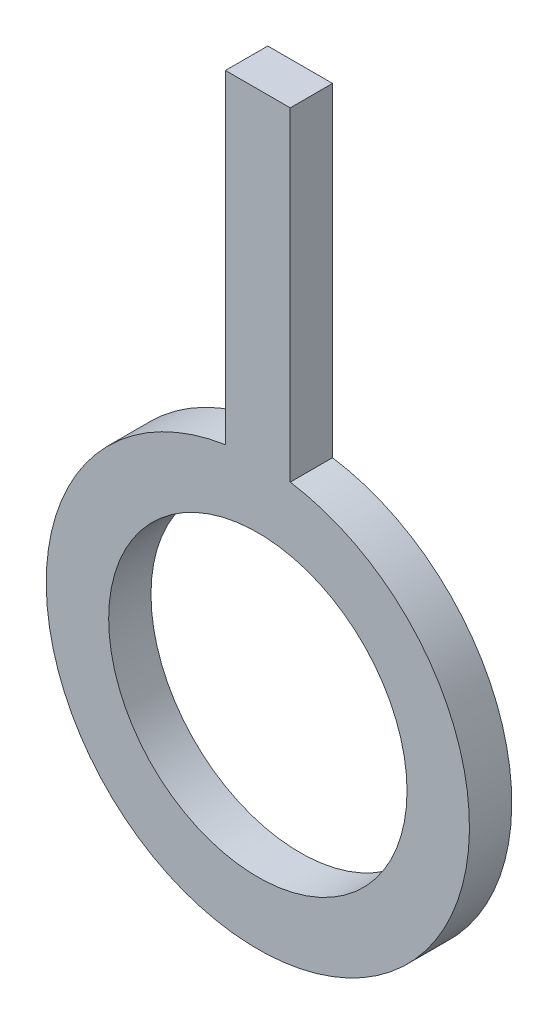
ISO-10303-21;
HEADER;
FILE_DESCRIPTION(('STEP AP214'),'2;1');
FILE_NAME('part.step','',(''),(''),'','','');
FILE_SCHEMA(('AUTOMOTIVE_DESIGN { 1 0 10303 214 1 1 1 1 }'));
ENDSEC;
DATA;
#1=APPLICATION_CONTEXT('core data for automotive mechanical design processes');
#2=APPLICATION_PROTOCOL_DEFINITION('international standard','automotive_design',2000,#1);
#3=PRODUCT_CONTEXT('',#1,'mechanical');
#4=PRODUCT('Part','Part','',(#3));
#5=PRODUCT_RELATED_PRODUCT_CATEGORY('part','',(#4));
#6=PRODUCT_DEFINITION_FORMATION('','',#4);
#7=PRODUCT_DEFINITION_CONTEXT('part definition',#1,'design');
#8=PRODUCT_DEFINITION('design','',#6,#7);
#9=PRODUCT_DEFINITION_SHAPE('','',#8);
#10=(LENGTH_UNIT() NAMED_UNIT(*) SI_UNIT(.MILLI.,.METRE.));
#11=(NAMED_UNIT(*) PLANE_ANGLE_UNIT() SI_UNIT($,.RADIAN.));
#12=(NAMED_UNIT(*) SI_UNIT($,.STERADIAN.) SOLID_ANGLE_UNIT());
#13=UNCERTAINTY_MEASURE_WITH_UNIT(LENGTH_MEASURE(1.E-05),#10,'distance_accuracy_value','');
#14=(GEOMETRIC_REPRESENTATION_CONTEXT(3) GLOBAL_UNCERTAINTY_ASSIGNED_CONTEXT((#13)) GLOBAL_UNIT_ASSIGNED_CONTEXT((#10,
#11,#12)) REPRESENTATION_CONTEXT('',''));
#15=CARTESIAN_POINT('',(0.,0.,0.));
#16=DIRECTION('',(0.,0.,1.));
#17=DIRECTION('',(1.,0.,0.));
#18=AXIS2_PLACEMENT_3D('',#15,#16,#17);
#19=CARTESIAN_POINT('',(-1.53093108923949,0.,2.));
#20=DIRECTION('',(1.,0.,0.));
#21=DIRECTION('',(0.,1.,0.));
#22=AXIS2_PLACEMENT_3D('',#19,#20,#21);
#23=PLANE('',#22);
#24=DIRECTION('',(0.,-1.,0.));
#25=VECTOR('',#24,1.);
#26=CARTESIAN_POINT('',(-1.53093108923949,0.,0.));
#27=LINE('',#26,#25);
#28=CARTESIAN_POINT('',(-1.53093108923949,25.1996593225076,0.));
#29=VERTEX_POINT('',#28);
#30=CARTESIAN_POINT('',(-1.53093108923949,9.88211768802619,0.));
#31=VERTEX_POINT('',#30);
#32=EDGE_CURVE('E114',#29,#31,#27,.T.);
#33=ORIENTED_EDGE('',*,*,#32,.T.);
#34=DIRECTION('',(0.,0.,-1.));
#35=VECTOR('',#34,1.);
#36=CARTESIAN_POINT('',(-1.53093108923949,9.88211768802619,2.));
#37=LINE('',#36,#35);
#38=CARTESIAN_POINT('',(-1.53093108923949,9.88211768802619,2.));
#39=VERTEX_POINT('',#38);
#40=EDGE_CURVE('E11',#39,#31,#37,.T.);
#41=ORIENTED_EDGE('',*,*,#40,.F.);
#42=DIRECTION('',(0.,-1.,0.));
#43=VECTOR('',#42,1.);
#44=CARTESIAN_POINT('',(-1.53093108923949,0.,2.));
#45=LINE('',#44,#43);
#46=CARTESIAN_POINT('',(-1.53093108923949,25.1996593225076,2.));
#47=VERTEX_POINT('',#46);
#48=EDGE_CURVE('E92',#47,#39,#45,.T.);
#49=ORIENTED_EDGE('',*,*,#48,.F.);
#50=DIRECTION('',(0.,0.,-1.));
#51=VECTOR('',#50,1.);
#52=CARTESIAN_POINT('',(-1.53093108923949,25.1996593225076,2.));
#53=LINE('',#52,#51);
#54=EDGE_CURVE('E59',#47,#29,#53,.T.);
#55=ORIENTED_EDGE('',*,*,#54,.T.);
#56=EDGE_LOOP('',(#33,#41,#49,#55));
#57=FACE_BOUND('',#56,.T.);
#58=ADVANCED_FACE('F41',(#57),#23,.F.);
#59=CARTESIAN_POINT('',(0.,0.,2.));
#60=DIRECTION('',(0.,0.,-1.));
#61=DIRECTION('',(-1.,0.,0.));
#62=AXIS2_PLACEMENT_3D('',#59,#60,#61);
#63=CYLINDRICAL_SURFACE('',#62,10.);
#64=CARTESIAN_POINT('',(0.,0.,0.));
#65=DIRECTION('',(0.,0.,1.));
#66=DIRECTION('',(1.,0.,0.));
#67=AXIS2_PLACEMENT_3D('',#64,#65,#66);
#68=CIRCLE('',#67,10.);
#69=CARTESIAN_POINT('',(1.53093108923949,9.88211768802619,0.));
#70=VERTEX_POINT('',#69);
#71=EDGE_CURVE('E98',#31,#70,#68,.T.);
#72=ORIENTED_EDGE('',*,*,#71,.T.);
#73=DIRECTION('',(0.,0.,-1.));
#74=VECTOR('',#73,1.);
#75=CARTESIAN_POINT('',(1.53093108923949,9.88211768802619,2.));
#76=LINE('',#75,#74);
#77=CARTESIAN_POINT('',(1.53093108923949,9.88211768802619,2.));
#78=VERTEX_POINT('',#77);
#79=EDGE_CURVE('E51',#78,#70,#76,.T.);
#80=ORIENTED_EDGE('',*,*,#79,.F.);
#81=CARTESIAN_POINT('',(0.,0.,2.));
#82=DIRECTION('',(0.,0.,1.));
#83=DIRECTION('',(1.,0.,0.));
#84=AXIS2_PLACEMENT_3D('',#81,#82,#83);
#85=CIRCLE('',#84,10.);
#86=EDGE_CURVE('E84',#39,#78,#85,.T.);
#87=ORIENTED_EDGE('',*,*,#86,.F.);
#88=ORIENTED_EDGE('',*,*,#40,.T.);
#89=EDGE_LOOP('',(#72,#80,#87,#88));
#90=FACE_BOUND('',#89,.T.);
#91=ADVANCED_FACE('F97',(#90),#63,.T.);
#92=CARTESIAN_POINT('',(1.53093108923949,0.,2.));
#93=DIRECTION('',(1.,0.,0.));
#94=DIRECTION('',(0.,1.,0.));
#95=AXIS2_PLACEMENT_3D('',#92,#93,#94);
#96=PLANE('',#95);
#97=DIRECTION('',(0.,-1.,0.));
#98=VECTOR('',#97,1.);
#99=CARTESIAN_POINT('',(1.53093108923949,0.,0.));
#100=LINE('',#99,#98);
#101=CARTESIAN_POINT('',(1.53093108923948,25.1996593225076,0.));
#102=VERTEX_POINT('',#101);
#103=EDGE_CURVE('E119',#102,#70,#100,.T.);
#104=ORIENTED_EDGE('',*,*,#103,.F.);
#105=DIRECTION('',(0.,0.,-1.));
#106=VECTOR('',#105,1.);
#107=CARTESIAN_POINT('',(1.53093108923948,25.1996593225076,2.));
#108=LINE('',#107,#106);
#109=CARTESIAN_POINT('',(1.53093108923948,25.1996593225076,2.));
#110=VERTEX_POINT('',#109);
#111=EDGE_CURVE('E73',#110,#102,#108,.T.);
#112=ORIENTED_EDGE('',*,*,#111,.F.);
#113=DIRECTION('',(0.,-1.,0.));
#114=VECTOR('',#113,1.);
#115=CARTESIAN_POINT('',(1.53093108923949,0.,2.));
#116=LINE('',#115,#114);
#117=EDGE_CURVE('E91',#110,#78,#116,.T.);
#118=ORIENTED_EDGE('',*,*,#117,.T.);
#119=ORIENTED_EDGE('',*,*,#79,.T.);
#120=EDGE_LOOP('',(#104,#112,#118,#119));
#121=FACE_BOUND('',#120,.T.);
#122=ADVANCED_FACE('F102',(#121),#96,.T.);
#123=CARTESIAN_POINT('',(0.,0.,2.));
#124=DIRECTION('',(0.,0.,-1.));
#125=DIRECTION('',(-1.,0.,0.));
#126=AXIS2_PLACEMENT_3D('',#123,#124,#125);
#127=CYLINDRICAL_SURFACE('',#126,7.05);
#128=CARTESIAN_POINT('',(0.,0.,2.));
#129=DIRECTION('',(0.,0.,1.));
#130=DIRECTION('',(1.,0.,0.));
#131=AXIS2_PLACEMENT_3D('',#128,#129,#130);
#132=CIRCLE('',#131,7.05);
#133=CARTESIAN_POINT('',(7.05,0.,2.));
#134=VERTEX_POINT('',#133);
#135=EDGE_CURVE('E126',#134,#134,#132,.T.);
#136=ORIENTED_EDGE('',*,*,#135,.T.);
#137=EDGE_LOOP('',(#136));
#138=FACE_BOUND('',#137,.T.);
#139=CARTESIAN_POINT('',(0.,0.,0.));
#140=DIRECTION('',(0.,0.,1.));
#141=DIRECTION('',(1.,0.,0.));
#142=AXIS2_PLACEMENT_3D('',#139,#140,#141);
#143=CIRCLE('',#142,7.05);
#144=CARTESIAN_POINT('',(7.05,0.,0.));
#145=VERTEX_POINT('',#144);
#146=EDGE_CURVE('E110',#145,#145,#143,.T.);
#147=ORIENTED_EDGE('',*,*,#146,.F.);
#148=EDGE_LOOP('',(#147));
#149=FACE_BOUND('',#148,.T.);
#150=ADVANCED_FACE('F43',(#138,#149),#127,.F.);
#151=CARTESIAN_POINT('',(0.,25.1996593225076,2.));
#152=DIRECTION('',(0.,1.,0.));
#153=DIRECTION('',(0.,0.,1.));
#154=AXIS2_PLACEMENT_3D('',#151,#152,#153);
#155=PLANE('',#154);
#156=DIRECTION('',(1.,0.,0.));
#157=VECTOR('',#156,1.);
#158=CARTESIAN_POINT('',(0.,25.1996593225076,0.));
#159=LINE('',#158,#157);
#160=EDGE_CURVE('E122',#29,#102,#159,.T.);
#161=ORIENTED_EDGE('',*,*,#160,.F.);
#162=ORIENTED_EDGE('',*,*,#54,.F.);
#163=DIRECTION('',(1.,0.,0.));
#164=VECTOR('',#163,1.);
#165=CARTESIAN_POINT('',(0.,25.1996593225076,2.));
#166=LINE('',#165,#164);
#167=EDGE_CURVE('E104',#47,#110,#166,.T.);
#168=ORIENTED_EDGE('',*,*,#167,.T.);
#169=ORIENTED_EDGE('',*,*,#111,.T.);
#170=EDGE_LOOP('',(#161,#162,#168,#169));
#171=FACE_BOUND('',#170,.T.);
#172=ADVANCED_FACE('F141',(#171),#155,.T.);
#173=CARTESIAN_POINT('',(0.,0.,2.));
#174=DIRECTION('',(0.,0.,1.));
#175=DIRECTION('',(1.,0.,0.));
#176=AXIS2_PLACEMENT_3D('',#173,#174,#175);
#177=PLANE('',#176);
#178=ORIENTED_EDGE('',*,*,#135,.F.);
#179=EDGE_LOOP('',(#178));
#180=FACE_BOUND('',#179,.T.);
#181=ORIENTED_EDGE('',*,*,#48,.T.);
#182=ORIENTED_EDGE('',*,*,#86,.T.);
#183=ORIENTED_EDGE('',*,*,#117,.F.);
#184=ORIENTED_EDGE('',*,*,#167,.F.);
#185=EDGE_LOOP('',(#181,#182,#183,#184));
#186=FACE_BOUND('',#185,.T.);
#187=ADVANCED_FACE('F88',(#180,#186),#177,.T.);
#188=CARTESIAN_POINT('',(0.,0.,0.));
#189=DIRECTION('',(0.,0.,1.));
#190=DIRECTION('',(1.,0.,0.));
#191=AXIS2_PLACEMENT_3D('',#188,#189,#190);
#192=PLANE('',#191);
#193=ORIENTED_EDGE('',*,*,#146,.T.);
#194=EDGE_LOOP('',(#193));
#195=FACE_BOUND('',#194,.T.);
#196=ORIENTED_EDGE('',*,*,#32,.F.);
#197=ORIENTED_EDGE('',*,*,#160,.T.);
#198=ORIENTED_EDGE('',*,*,#103,.T.);
#199=ORIENTED_EDGE('',*,*,#71,.F.);
#200=EDGE_LOOP('',(#196,#197,#198,#199));
#201=FACE_BOUND('',#200,.T.);
#202=ADVANCED_FACE('F140',(#195,#201),#192,.F.);
#203=CLOSED_SHELL('',(#58,#91,#122,#150,#172,#187,#202));
#204=MANIFOLD_SOLID_BREP('B2',#203);
#205=ADVANCED_BREP_SHAPE_REPRESENTATION('',(#18,#204),#14);
#206=SHAPE_DEFINITION_REPRESENTATION(#9,#205);
ENDSEC;
END-ISO-10303-21;
